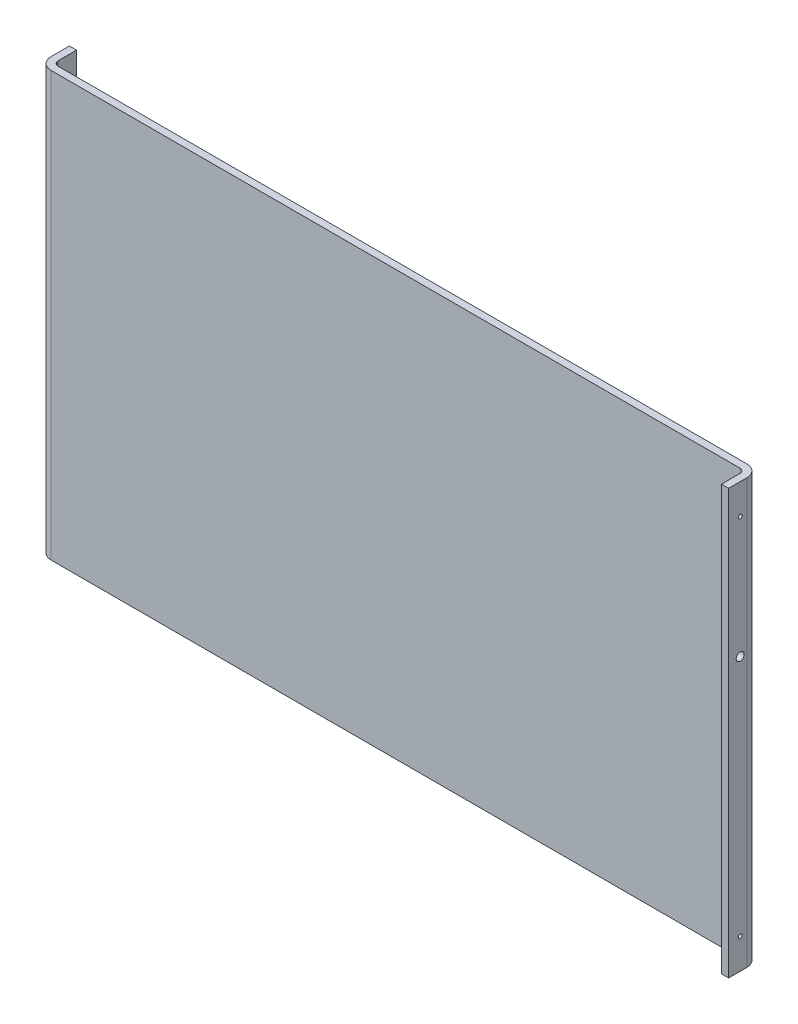
ISO-10303-21;
HEADER;
FILE_DESCRIPTION(('STEP AP214'),'2;1');
FILE_NAME('part.step','',(''),(''),'','','');
FILE_SCHEMA(('AUTOMOTIVE_DESIGN { 1 0 10303 214 1 1 1 1 }'));
ENDSEC;
DATA;
#1=APPLICATION_CONTEXT('core data for automotive mechanical design processes');
#2=APPLICATION_PROTOCOL_DEFINITION('international standard','automotive_design',2000,#1);
#3=PRODUCT_CONTEXT('',#1,'mechanical');
#4=PRODUCT('Part','Part','',(#3));
#5=PRODUCT_RELATED_PRODUCT_CATEGORY('part','',(#4));
#6=PRODUCT_DEFINITION_FORMATION('','',#4);
#7=PRODUCT_DEFINITION_CONTEXT('part definition',#1,'design');
#8=PRODUCT_DEFINITION('design','',#6,#7);
#9=PRODUCT_DEFINITION_SHAPE('','',#8);
#10=(LENGTH_UNIT() NAMED_UNIT(*) SI_UNIT(.MILLI.,.METRE.));
#11=(NAMED_UNIT(*) PLANE_ANGLE_UNIT() SI_UNIT($,.RADIAN.));
#12=(NAMED_UNIT(*) SI_UNIT($,.STERADIAN.) SOLID_ANGLE_UNIT());
#13=UNCERTAINTY_MEASURE_WITH_UNIT(LENGTH_MEASURE(1.E-05),#10,'distance_accuracy_value','');
#14=(GEOMETRIC_REPRESENTATION_CONTEXT(3) GLOBAL_UNCERTAINTY_ASSIGNED_CONTEXT((#13)) GLOBAL_UNIT_ASSIGNED_CONTEXT((#10,
#11,#12)) REPRESENTATION_CONTEXT('',''));
#15=CARTESIAN_POINT('',(0.,0.,0.));
#16=DIRECTION('',(0.,0.,1.));
#17=DIRECTION('',(1.,0.,0.));
#18=AXIS2_PLACEMENT_3D('',#15,#16,#17);
#19=CARTESIAN_POINT('',(295.800000062,152.4,12.7));
#20=DIRECTION('',(1.,0.,0.));
#21=DIRECTION('',(0.,0.,-1.));
#22=AXIS2_PLACEMENT_3D('',#19,#20,#21);
#23=CYLINDRICAL_SURFACE('',#22,1.6256);
#24=CARTESIAN_POINT('',(295.800000062,152.4,12.7));
#25=DIRECTION('',(1.,0.,0.));
#26=DIRECTION('',(0.,0.,-1.));
#27=AXIS2_PLACEMENT_3D('',#24,#25,#26);
#28=CIRCLE('',#27,1.6256);
#29=CARTESIAN_POINT('',(295.800000062,152.4,11.0744));
#30=VERTEX_POINT('',#29);
#31=EDGE_CURVE('E21',#30,#30,#28,.T.);
#32=ORIENTED_EDGE('',*,*,#31,.F.);
#33=EDGE_LOOP('',(#32));
#34=FACE_BOUND('',#33,.T.);
#35=CARTESIAN_POINT('',(301.8,152.4,12.7));
#36=DIRECTION('',(1.,0.,0.));
#37=DIRECTION('',(0.,0.,-1.));
#38=AXIS2_PLACEMENT_3D('',#35,#36,#37);
#39=CIRCLE('',#38,1.6256);
#40=CARTESIAN_POINT('',(301.8,152.4,11.0744));
#41=VERTEX_POINT('',#40);
#42=EDGE_CURVE('E144',#41,#41,#39,.T.);
#43=ORIENTED_EDGE('',*,*,#42,.T.);
#44=EDGE_LOOP('',(#43));
#45=FACE_BOUND('',#44,.T.);
#46=ADVANCED_FACE('F17',(#34,#45),#23,.F.);
#47=CARTESIAN_POINT('',(295.800000062,50.8,12.7));
#48=DIRECTION('',(1.,0.,0.));
#49=DIRECTION('',(0.,0.,-1.));
#50=AXIS2_PLACEMENT_3D('',#47,#48,#49);
#51=CYLINDRICAL_SURFACE('',#50,3.3655);
#52=CARTESIAN_POINT('',(295.800000062,50.8,12.7));
#53=DIRECTION('',(1.,0.,0.));
#54=DIRECTION('',(0.,0.,-1.));
#55=AXIS2_PLACEMENT_3D('',#52,#53,#54);
#56=CIRCLE('',#55,3.3655);
#57=CARTESIAN_POINT('',(295.800000062,50.8,9.3345));
#58=VERTEX_POINT('',#57);
#59=EDGE_CURVE('E151',#58,#58,#56,.T.);
#60=ORIENTED_EDGE('',*,*,#59,.F.);
#61=EDGE_LOOP('',(#60));
#62=FACE_BOUND('',#61,.T.);
#63=CARTESIAN_POINT('',(301.8,50.8,12.7));
#64=DIRECTION('',(1.,0.,0.));
#65=DIRECTION('',(0.,0.,-1.));
#66=AXIS2_PLACEMENT_3D('',#63,#64,#65);
#67=CIRCLE('',#66,3.3655);
#68=CARTESIAN_POINT('',(301.8,50.8,9.3345));
#69=VERTEX_POINT('',#68);
#70=EDGE_CURVE('E141',#69,#69,#67,.T.);
#71=ORIENTED_EDGE('',*,*,#70,.T.);
#72=EDGE_LOOP('',(#71));
#73=FACE_BOUND('',#72,.T.);
#74=ADVANCED_FACE('F317',(#62,#73),#51,.F.);
#75=CARTESIAN_POINT('',(295.800000062,-152.4,12.7));
#76=DIRECTION('',(1.,0.,0.));
#77=DIRECTION('',(0.,0.,-1.));
#78=AXIS2_PLACEMENT_3D('',#75,#76,#77);
#79=CYLINDRICAL_SURFACE('',#78,1.6256);
#80=CARTESIAN_POINT('',(295.800000062,-152.4,12.7));
#81=DIRECTION('',(1.,0.,0.));
#82=DIRECTION('',(0.,0.,-1.));
#83=AXIS2_PLACEMENT_3D('',#80,#81,#82);
#84=CIRCLE('',#83,1.6256);
#85=CARTESIAN_POINT('',(295.800000062,-152.4,11.0744));
#86=VERTEX_POINT('',#85);
#87=EDGE_CURVE('E148',#86,#86,#84,.T.);
#88=ORIENTED_EDGE('',*,*,#87,.F.);
#89=EDGE_LOOP('',(#88));
#90=FACE_BOUND('',#89,.T.);
#91=CARTESIAN_POINT('',(301.8,-152.4,12.7));
#92=DIRECTION('',(1.,0.,0.));
#93=DIRECTION('',(0.,0.,-1.));
#94=AXIS2_PLACEMENT_3D('',#91,#92,#93);
#95=CIRCLE('',#94,1.6256);
#96=CARTESIAN_POINT('',(301.8,-152.4,11.0744));
#97=VERTEX_POINT('',#96);
#98=EDGE_CURVE('E137',#97,#97,#95,.T.);
#99=ORIENTED_EDGE('',*,*,#98,.T.);
#100=EDGE_LOOP('',(#99));
#101=FACE_BOUND('',#100,.T.);
#102=ADVANCED_FACE('F308',(#90,#101),#79,.F.);
#103=CARTESIAN_POINT('',(291.800000062,177.8,6.999999938));
#104=DIRECTION('',(0.,-1.,0.));
#105=DIRECTION('',(0.,0.,-1.));
#106=AXIS2_PLACEMENT_3D('',#103,#104,#105);
#107=CYLINDRICAL_SURFACE('',#106,4.);
#108=CARTESIAN_POINT('',(291.800000062,177.8,6.999999938));
#109=DIRECTION('',(0.,-1.,0.));
#110=DIRECTION('',(0.,0.,-1.));
#111=AXIS2_PLACEMENT_3D('',#108,#109,#110);
#112=CIRCLE('',#111,4.);
#113=CARTESIAN_POINT('',(291.800000062,177.8,2.9999999306));
#114=VERTEX_POINT('',#113);
#115=CARTESIAN_POINT('',(295.799999924511,177.8,6.999999938));
#116=VERTEX_POINT('',#115);
#117=EDGE_CURVE('E208',#114,#116,#112,.T.);
#118=ORIENTED_EDGE('',*,*,#117,.F.);
#119=DIRECTION('',(0.,1.,0.));
#120=VECTOR('',#119,1.);
#121=CARTESIAN_POINT('',(291.800000062,0.,2.999999938));
#122=LINE('',#121,#120);
#123=CARTESIAN_POINT('',(291.800000062,-177.8,2.9999999306));
#124=VERTEX_POINT('',#123);
#125=EDGE_CURVE('E125',#124,#114,#122,.T.);
#126=ORIENTED_EDGE('',*,*,#125,.F.);
#127=CARTESIAN_POINT('',(291.800000062,-177.8,6.999999938));
#128=DIRECTION('',(0.,-1.,0.));
#129=DIRECTION('',(0.,0.,-1.));
#130=AXIS2_PLACEMENT_3D('',#127,#128,#129);
#131=CIRCLE('',#130,4.);
#132=CARTESIAN_POINT('',(295.799999924511,-177.8,6.999999938));
#133=VERTEX_POINT('',#132);
#134=EDGE_CURVE('E203',#124,#133,#131,.T.);
#135=ORIENTED_EDGE('',*,*,#134,.T.);
#136=DIRECTION('',(0.,-1.,0.));
#137=VECTOR('',#136,1.);
#138=CARTESIAN_POINT('',(295.800000062,0.,6.999999938));
#139=LINE('',#138,#137);
#140=EDGE_CURVE('E156',#116,#133,#139,.T.);
#141=ORIENTED_EDGE('',*,*,#140,.F.);
#142=EDGE_LOOP('',(#118,#126,#135,#141));
#143=FACE_BOUND('',#142,.T.);
#144=ADVANCED_FACE('F306',(#143),#107,.F.);
#145=CARTESIAN_POINT('',(295.800000062,-177.8,6.999999938));
#146=DIRECTION('',(-1.,0.,0.));
#147=DIRECTION('',(0.,0.,1.));
#148=AXIS2_PLACEMENT_3D('',#145,#146,#147);
#149=PLANE('',#148);
#150=ORIENTED_EDGE('',*,*,#87,.T.);
#151=EDGE_LOOP('',(#150));
#152=FACE_BOUND('',#151,.T.);
#153=ORIENTED_EDGE('',*,*,#59,.T.);
#154=EDGE_LOOP('',(#153));
#155=FACE_BOUND('',#154,.T.);
#156=ORIENTED_EDGE('',*,*,#31,.T.);
#157=EDGE_LOOP('',(#156));
#158=FACE_BOUND('',#157,.T.);
#159=DIRECTION('',(0.,1.,0.));
#160=VECTOR('',#159,1.);
#161=CARTESIAN_POINT('',(295.800000062,0.,22.4));
#162=LINE('',#161,#160);
#163=CARTESIAN_POINT('',(295.799999878682,-177.8,22.4));
#164=VERTEX_POINT('',#163);
#165=CARTESIAN_POINT('',(295.799999878682,177.8,22.4));
#166=VERTEX_POINT('',#165);
#167=EDGE_CURVE('E150',#164,#166,#162,.T.);
#168=ORIENTED_EDGE('',*,*,#167,.T.);
#169=DIRECTION('',(0.,0.,1.));
#170=VECTOR('',#169,1.);
#171=CARTESIAN_POINT('',(295.799999787023,177.8,0.));
#172=LINE('',#171,#170);
#173=EDGE_CURVE('E172',#116,#166,#172,.T.);
#174=ORIENTED_EDGE('',*,*,#173,.F.);
#175=ORIENTED_EDGE('',*,*,#140,.T.);
#176=DIRECTION('',(0.,0.,1.));
#177=VECTOR('',#176,1.);
#178=CARTESIAN_POINT('',(295.799999787023,-177.8,0.));
#179=LINE('',#178,#177);
#180=EDGE_CURVE('E206',#133,#164,#179,.T.);
#181=ORIENTED_EDGE('',*,*,#180,.T.);
#182=EDGE_LOOP('',(#168,#174,#175,#181));
#183=FACE_BOUND('',#182,.T.);
#184=ADVANCED_FACE('F247',(#152,#155,#158,#183),#149,.T.);
#185=CARTESIAN_POINT('',(301.8,-177.8,22.4));
#186=DIRECTION('',(0.,0.,-1.));
#187=DIRECTION('',(-1.,0.,0.));
#188=AXIS2_PLACEMENT_3D('',#185,#186,#187);
#189=PLANE('',#188);
#190=DIRECTION('',(0.,1.,0.));
#191=VECTOR('',#190,1.);
#192=CARTESIAN_POINT('',(301.8,0.,22.4));
#193=LINE('',#192,#191);
#194=CARTESIAN_POINT('',(301.8,-177.8,22.4));
#195=VERTEX_POINT('',#194);
#196=CARTESIAN_POINT('',(301.8,177.8,22.4));
#197=VERTEX_POINT('',#196);
#198=EDGE_CURVE('E147',#195,#197,#193,.T.);
#199=ORIENTED_EDGE('',*,*,#198,.T.);
#200=DIRECTION('',(1.,0.,0.));
#201=VECTOR('',#200,1.);
#202=CARTESIAN_POINT('',(3.00000003100004,177.8,22.4));
#203=LINE('',#202,#201);
#204=EDGE_CURVE('E169',#166,#197,#203,.T.);
#205=ORIENTED_EDGE('',*,*,#204,.F.);
#206=ORIENTED_EDGE('',*,*,#167,.F.);
#207=DIRECTION('',(1.,0.,0.));
#208=VECTOR('',#207,1.);
#209=CARTESIAN_POINT('',(3.00000003100004,-177.8,22.4));
#210=LINE('',#209,#208);
#211=EDGE_CURVE('E241',#164,#195,#210,.T.);
#212=ORIENTED_EDGE('',*,*,#211,.T.);
#213=EDGE_LOOP('',(#199,#205,#206,#212));
#214=FACE_BOUND('',#213,.T.);
#215=ADVANCED_FACE('F250',(#214),#189,.F.);
#216=CARTESIAN_POINT('',(301.8,-177.8,6.999999938));
#217=DIRECTION('',(-1.,0.,0.));
#218=DIRECTION('',(0.,0.,1.));
#219=AXIS2_PLACEMENT_3D('',#216,#217,#218);
#220=PLANE('',#219);
#221=ORIENTED_EDGE('',*,*,#98,.F.);
#222=EDGE_LOOP('',(#221));
#223=FACE_BOUND('',#222,.T.);
#224=ORIENTED_EDGE('',*,*,#70,.F.);
#225=EDGE_LOOP('',(#224));
#226=FACE_BOUND('',#225,.T.);
#227=ORIENTED_EDGE('',*,*,#42,.F.);
#228=EDGE_LOOP('',(#227));
#229=FACE_BOUND('',#228,.T.);
#230=ORIENTED_EDGE('',*,*,#198,.F.);
#231=DIRECTION('',(0.,0.,-1.));
#232=VECTOR('',#231,1.);
#233=CARTESIAN_POINT('',(301.8,-177.8,0.));
#234=LINE('',#233,#232);
#235=CARTESIAN_POINT('',(301.8,-177.8,6.99999993902551));
#236=VERTEX_POINT('',#235);
#237=EDGE_CURVE('E202',#195,#236,#234,.T.);
#238=ORIENTED_EDGE('',*,*,#237,.T.);
#239=DIRECTION('',(0.,-1.,0.));
#240=VECTOR('',#239,1.);
#241=CARTESIAN_POINT('',(301.8,0.,6.99999994005102));
#242=LINE('',#241,#240);
#243=CARTESIAN_POINT('',(301.8,177.8,6.99999993902551));
#244=VERTEX_POINT('',#243);
#245=EDGE_CURVE('E140',#236,#244,#242,.F.);
#246=ORIENTED_EDGE('',*,*,#245,.T.);
#247=DIRECTION('',(0.,0.,-1.));
#248=VECTOR('',#247,1.);
#249=CARTESIAN_POINT('',(301.8,177.8,0.));
#250=LINE('',#249,#248);
#251=EDGE_CURVE('E171',#197,#244,#250,.T.);
#252=ORIENTED_EDGE('',*,*,#251,.F.);
#253=EDGE_LOOP('',(#230,#238,#246,#252));
#254=FACE_BOUND('',#253,.T.);
#255=ADVANCED_FACE('F255',(#223,#226,#229,#254),#220,.F.);
#256=CARTESIAN_POINT('',(291.800000062,177.8,6.999999938));
#257=DIRECTION('',(0.,-1.,0.));
#258=DIRECTION('',(0.,0.,-1.));
#259=AXIS2_PLACEMENT_3D('',#256,#257,#258);
#260=CYLINDRICAL_SURFACE('',#259,9.999999938);
#261=CARTESIAN_POINT('',(291.800000062,177.8,6.999999938));
#262=DIRECTION('',(0.,-1.,0.));
#263=DIRECTION('',(0.,0.,-1.));
#264=AXIS2_PLACEMENT_3D('',#261,#262,#263);
#265=CIRCLE('',#264,9.999999938);
#266=CARTESIAN_POINT('',(291.800000062,177.8,-3.0000000064));
#267=VERTEX_POINT('',#266);
#268=EDGE_CURVE('E113',#244,#267,#265,.F.);
#269=ORIENTED_EDGE('',*,*,#268,.F.);
#270=ORIENTED_EDGE('',*,*,#245,.F.);
#271=CARTESIAN_POINT('',(291.800000062,-177.8,6.999999938));
#272=DIRECTION('',(0.,-1.,0.));
#273=DIRECTION('',(0.,0.,-1.));
#274=AXIS2_PLACEMENT_3D('',#271,#272,#273);
#275=CIRCLE('',#274,9.999999938);
#276=CARTESIAN_POINT('',(291.800000062,-177.8,-3.0000000064));
#277=VERTEX_POINT('',#276);
#278=EDGE_CURVE('E199',#236,#277,#275,.F.);
#279=ORIENTED_EDGE('',*,*,#278,.T.);
#280=DIRECTION('',(0.,1.,0.));
#281=VECTOR('',#280,1.);
#282=CARTESIAN_POINT('',(291.800000062,0.,-3.));
#283=LINE('',#282,#281);
#284=EDGE_CURVE('E232',#277,#267,#283,.T.);
#285=ORIENTED_EDGE('',*,*,#284,.T.);
#286=EDGE_LOOP('',(#269,#270,#279,#285));
#287=FACE_BOUND('',#286,.T.);
#288=ADVANCED_FACE('F259',(#287),#260,.T.);
#289=CARTESIAN_POINT('',(-285.8,-177.8,-3.));
#290=DIRECTION('',(0.,0.,1.));
#291=DIRECTION('',(1.,0.,0.));
#292=AXIS2_PLACEMENT_3D('',#289,#290,#291);
#293=PLANE('',#292);
#294=ORIENTED_EDGE('',*,*,#284,.F.);
#295=DIRECTION('',(-1.,0.,0.));
#296=VECTOR('',#295,1.);
#297=CARTESIAN_POINT('',(3.00000003100004,-177.8,-3.0000000128));
#298=LINE('',#297,#296);
#299=CARTESIAN_POINT('',(-285.800000000359,-177.8,-3.0000000064));
#300=VERTEX_POINT('',#299);
#301=EDGE_CURVE('E121',#277,#300,#298,.T.);
#302=ORIENTED_EDGE('',*,*,#301,.T.);
#303=DIRECTION('',(0.,1.,0.));
#304=VECTOR('',#303,1.);
#305=CARTESIAN_POINT('',(-285.800000000718,0.,-3.));
#306=LINE('',#305,#304);
#307=CARTESIAN_POINT('',(-285.800000000359,177.8,-3.0000000064));
#308=VERTEX_POINT('',#307);
#309=EDGE_CURVE('E118',#308,#300,#306,.F.);
#310=ORIENTED_EDGE('',*,*,#309,.F.);
#311=DIRECTION('',(-1.,0.,0.));
#312=VECTOR('',#311,1.);
#313=CARTESIAN_POINT('',(3.00000003100004,177.8,-3.0000000128));
#314=LINE('',#313,#312);
#315=EDGE_CURVE('E105',#267,#308,#314,.T.);
#316=ORIENTED_EDGE('',*,*,#315,.F.);
#317=EDGE_LOOP('',(#294,#302,#310,#316));
#318=FACE_BOUND('',#317,.T.);
#319=ADVANCED_FACE('F119',(#318),#293,.F.);
#320=CARTESIAN_POINT('',(-285.8,-177.8,2.999999938));
#321=DIRECTION('',(0.,0.,1.));
#322=DIRECTION('',(1.,0.,0.));
#323=AXIS2_PLACEMENT_3D('',#320,#321,#322);
#324=PLANE('',#323);
#325=ORIENTED_EDGE('',*,*,#125,.T.);
#326=DIRECTION('',(1.,0.,0.));
#327=VECTOR('',#326,1.);
#328=CARTESIAN_POINT('',(3.00000003100004,177.8,2.9999999232));
#329=LINE('',#328,#327);
#330=CARTESIAN_POINT('',(-285.800000000898,177.8,2.9999999306));
#331=VERTEX_POINT('',#330);
#332=EDGE_CURVE('E133',#331,#114,#329,.T.);
#333=ORIENTED_EDGE('',*,*,#332,.F.);
#334=DIRECTION('',(0.,1.,0.));
#335=VECTOR('',#334,1.);
#336=CARTESIAN_POINT('',(-285.800000001796,0.,2.999999938));
#337=LINE('',#336,#335);
#338=CARTESIAN_POINT('',(-285.800000000898,-177.8,2.9999999306));
#339=VERTEX_POINT('',#338);
#340=EDGE_CURVE('E115',#331,#339,#337,.F.);
#341=ORIENTED_EDGE('',*,*,#340,.T.);
#342=DIRECTION('',(1.,0.,0.));
#343=VECTOR('',#342,1.);
#344=CARTESIAN_POINT('',(3.00000003100004,-177.8,2.9999999232));
#345=LINE('',#344,#343);
#346=EDGE_CURVE('E195',#339,#124,#345,.T.);
#347=ORIENTED_EDGE('',*,*,#346,.T.);
#348=EDGE_LOOP('',(#325,#333,#341,#347));
#349=FACE_BOUND('',#348,.T.);
#350=ADVANCED_FACE('F302',(#349),#324,.T.);
#351=CARTESIAN_POINT('',(-285.8,-177.8,-7.));
#352=DIRECTION('',(0.,1.,0.));
#353=DIRECTION('',(0.,0.,1.));
#354=AXIS2_PLACEMENT_3D('',#351,#352,#353);
#355=CYLINDRICAL_SURFACE('',#354,4.);
#356=CARTESIAN_POINT('',(-285.8,177.8,-7.));
#357=DIRECTION('',(0.,1.,0.));
#358=DIRECTION('',(0.,0.,1.));
#359=AXIS2_PLACEMENT_3D('',#356,#357,#358);
#360=CIRCLE('',#359,4.);
#361=CARTESIAN_POINT('',(-289.8,177.8,-7.));
#362=VERTEX_POINT('',#361);
#363=EDGE_CURVE('E110',#308,#362,#360,.F.);
#364=ORIENTED_EDGE('',*,*,#363,.F.);
#365=ORIENTED_EDGE('',*,*,#309,.T.);
#366=CARTESIAN_POINT('',(-285.8,-177.8,-7.));
#367=DIRECTION('',(0.,1.,0.));
#368=DIRECTION('',(0.,0.,1.));
#369=AXIS2_PLACEMENT_3D('',#366,#367,#368);
#370=CIRCLE('',#369,4.);
#371=CARTESIAN_POINT('',(-289.8,-177.8,-7.));
#372=VERTEX_POINT('',#371);
#373=EDGE_CURVE('E197',#300,#372,#370,.F.);
#374=ORIENTED_EDGE('',*,*,#373,.T.);
#375=DIRECTION('',(0.,1.,0.));
#376=VECTOR('',#375,1.);
#377=CARTESIAN_POINT('',(-289.8,0.,-7.));
#378=LINE('',#377,#376);
#379=EDGE_CURVE('E129',#372,#362,#378,.T.);
#380=ORIENTED_EDGE('',*,*,#379,.T.);
#381=EDGE_LOOP('',(#364,#365,#374,#380));
#382=FACE_BOUND('',#381,.T.);
#383=ADVANCED_FACE('F128',(#382),#355,.F.);
#384=CARTESIAN_POINT('',(-285.8,-177.8,-7.));
#385=DIRECTION('',(0.,1.,0.));
#386=DIRECTION('',(0.,0.,1.));
#387=AXIS2_PLACEMENT_3D('',#384,#385,#386);
#388=CYLINDRICAL_SURFACE('',#387,9.999999938);
#389=CARTESIAN_POINT('',(-285.8,177.8,-7.));
#390=DIRECTION('',(0.,1.,0.));
#391=DIRECTION('',(0.,0.,1.));
#392=AXIS2_PLACEMENT_3D('',#389,#390,#391);
#393=CIRCLE('',#392,9.999999938);
#394=CARTESIAN_POINT('',(-295.799999938,177.8,-7.));
#395=VERTEX_POINT('',#394);
#396=EDGE_CURVE('E130',#395,#331,#393,.T.);
#397=ORIENTED_EDGE('',*,*,#396,.F.);
#398=DIRECTION('',(0.,1.,0.));
#399=VECTOR('',#398,1.);
#400=CARTESIAN_POINT('',(-295.799999938,0.,-7.));
#401=LINE('',#400,#399);
#402=CARTESIAN_POINT('',(-295.799999938,-177.8,-7.));
#403=VERTEX_POINT('',#402);
#404=EDGE_CURVE('E187',#403,#395,#401,.T.);
#405=ORIENTED_EDGE('',*,*,#404,.F.);
#406=CARTESIAN_POINT('',(-285.8,-177.8,-7.));
#407=DIRECTION('',(0.,1.,0.));
#408=DIRECTION('',(0.,0.,1.));
#409=AXIS2_PLACEMENT_3D('',#406,#407,#408);
#410=CIRCLE('',#409,9.999999938);
#411=EDGE_CURVE('E192',#403,#339,#410,.T.);
#412=ORIENTED_EDGE('',*,*,#411,.T.);
#413=ORIENTED_EDGE('',*,*,#340,.F.);
#414=EDGE_LOOP('',(#397,#405,#412,#413));
#415=FACE_BOUND('',#414,.T.);
#416=ADVANCED_FACE('F300',(#415),#388,.T.);
#417=CARTESIAN_POINT('',(-295.799999938,177.8,-22.4));
#418=DIRECTION('',(0.,1.,0.));
#419=DIRECTION('',(0.,0.,1.));
#420=AXIS2_PLACEMENT_3D('',#417,#418,#419);
#421=PLANE('',#420);
#422=ORIENTED_EDGE('',*,*,#251,.T.);
#423=ORIENTED_EDGE('',*,*,#268,.T.);
#424=ORIENTED_EDGE('',*,*,#315,.T.);
#425=ORIENTED_EDGE('',*,*,#363,.T.);
#426=DIRECTION('',(0.,0.,-1.));
#427=VECTOR('',#426,1.);
#428=CARTESIAN_POINT('',(-289.8,177.8,-14.7));
#429=LINE('',#428,#427);
#430=CARTESIAN_POINT('',(-289.8,177.8,-22.4));
#431=VERTEX_POINT('',#430);
#432=EDGE_CURVE('E218',#362,#431,#429,.T.);
#433=ORIENTED_EDGE('',*,*,#432,.T.);
#434=DIRECTION('',(1.,0.,0.));
#435=VECTOR('',#434,1.);
#436=CARTESIAN_POINT('',(-292.799999969,177.8,-22.4));
#437=LINE('',#436,#435);
#438=CARTESIAN_POINT('',(-295.799999938,177.8,-22.4));
#439=VERTEX_POINT('',#438);
#440=EDGE_CURVE('E207',#439,#431,#437,.T.);
#441=ORIENTED_EDGE('',*,*,#440,.F.);
#442=DIRECTION('',(0.,0.,-1.));
#443=VECTOR('',#442,1.);
#444=CARTESIAN_POINT('',(-295.799999938,177.8,-14.7));
#445=LINE('',#444,#443);
#446=EDGE_CURVE('E272',#395,#439,#445,.T.);
#447=ORIENTED_EDGE('',*,*,#446,.F.);
#448=ORIENTED_EDGE('',*,*,#396,.T.);
#449=ORIENTED_EDGE('',*,*,#332,.T.);
#450=ORIENTED_EDGE('',*,*,#117,.T.);
#451=ORIENTED_EDGE('',*,*,#173,.T.);
#452=ORIENTED_EDGE('',*,*,#204,.T.);
#453=EDGE_LOOP('',(#422,#423,#424,#425,#433,#441,#447,#448,#449,#450,#451,#452));
#454=FACE_BOUND('',#453,.T.);
#455=ADVANCED_FACE('F107',(#454),#421,.T.);
#456=CARTESIAN_POINT('',(-289.8,-177.8,-22.4));
#457=DIRECTION('',(0.,0.,-1.));
#458=DIRECTION('',(-1.,0.,0.));
#459=AXIS2_PLACEMENT_3D('',#456,#457,#458);
#460=PLANE('',#459);
#461=DIRECTION('',(0.,-1.,0.));
#462=VECTOR('',#461,1.);
#463=CARTESIAN_POINT('',(-295.799999938,0.,-22.4));
#464=LINE('',#463,#462);
#465=CARTESIAN_POINT('',(-295.799999938,-177.8,-22.4));
#466=VERTEX_POINT('',#465);
#467=EDGE_CURVE('E36',#439,#466,#464,.T.);
#468=ORIENTED_EDGE('',*,*,#467,.F.);
#469=ORIENTED_EDGE('',*,*,#440,.T.);
#470=DIRECTION('',(0.,-1.,0.));
#471=VECTOR('',#470,1.);
#472=CARTESIAN_POINT('',(-289.8,0.,-22.4));
#473=LINE('',#472,#471);
#474=CARTESIAN_POINT('',(-289.799999908341,-177.8,-22.4));
#475=VERTEX_POINT('',#474);
#476=EDGE_CURVE('E221',#431,#475,#473,.T.);
#477=ORIENTED_EDGE('',*,*,#476,.T.);
#478=DIRECTION('',(-1.,0.,0.));
#479=VECTOR('',#478,1.);
#480=CARTESIAN_POINT('',(3.00000003100004,-177.8,-22.4));
#481=LINE('',#480,#479);
#482=EDGE_CURVE('E196',#475,#466,#481,.T.);
#483=ORIENTED_EDGE('',*,*,#482,.T.);
#484=EDGE_LOOP('',(#468,#469,#477,#483));
#485=FACE_BOUND('',#484,.T.);
#486=ADVANCED_FACE('F295',(#485),#460,.T.);
#487=CARTESIAN_POINT('',(-295.799999938,-177.8,-22.4));
#488=DIRECTION('',(0.,1.,0.));
#489=DIRECTION('',(0.,0.,1.));
#490=AXIS2_PLACEMENT_3D('',#487,#488,#489);
#491=PLANE('',#490);
#492=ORIENTED_EDGE('',*,*,#411,.F.);
#493=DIRECTION('',(0.,0.,1.));
#494=VECTOR('',#493,1.);
#495=CARTESIAN_POINT('',(-295.799999938,-177.8,-14.7));
#496=LINE('',#495,#494);
#497=EDGE_CURVE('E183',#466,#403,#496,.T.);
#498=ORIENTED_EDGE('',*,*,#497,.F.);
#499=ORIENTED_EDGE('',*,*,#482,.F.);
#500=DIRECTION('',(0.,0.,1.));
#501=VECTOR('',#500,1.);
#502=CARTESIAN_POINT('',(-289.8,-177.8,-14.7));
#503=LINE('',#502,#501);
#504=EDGE_CURVE('E191',#475,#372,#503,.T.);
#505=ORIENTED_EDGE('',*,*,#504,.T.);
#506=ORIENTED_EDGE('',*,*,#373,.F.);
#507=ORIENTED_EDGE('',*,*,#301,.F.);
#508=ORIENTED_EDGE('',*,*,#278,.F.);
#509=ORIENTED_EDGE('',*,*,#237,.F.);
#510=ORIENTED_EDGE('',*,*,#211,.F.);
#511=ORIENTED_EDGE('',*,*,#180,.F.);
#512=ORIENTED_EDGE('',*,*,#134,.F.);
#513=ORIENTED_EDGE('',*,*,#346,.F.);
#514=EDGE_LOOP('',(#492,#498,#499,#505,#506,#507,#508,#509,#510,#511,#512,#513));
#515=FACE_BOUND('',#514,.T.);
#516=ADVANCED_FACE('F261',(#515),#491,.F.);
#517=CARTESIAN_POINT('',(-289.8,50.8,-12.7));
#518=DIRECTION('',(-1.,0.,0.));
#519=DIRECTION('',(0.,-1.,0.));
#520=AXIS2_PLACEMENT_3D('',#517,#518,#519);
#521=CYLINDRICAL_SURFACE('',#520,3.3655);
#522=CARTESIAN_POINT('',(-289.8,50.8,-12.7));
#523=DIRECTION('',(-1.,0.,0.));
#524=DIRECTION('',(0.,-1.,0.));
#525=AXIS2_PLACEMENT_3D('',#522,#523,#524);
#526=CIRCLE('',#525,3.3655);
#527=CARTESIAN_POINT('',(-289.8,47.4345,-12.7));
#528=VERTEX_POINT('',#527);
#529=EDGE_CURVE('E188',#528,#528,#526,.F.);
#530=ORIENTED_EDGE('',*,*,#529,.T.);
#531=EDGE_LOOP('',(#530));
#532=FACE_BOUND('',#531,.T.);
#533=CARTESIAN_POINT('',(-295.799999938,50.8,-12.7));
#534=DIRECTION('',(-1.,0.,0.));
#535=DIRECTION('',(0.,-1.,0.));
#536=AXIS2_PLACEMENT_3D('',#533,#534,#535);
#537=CIRCLE('',#536,3.3655);
#538=CARTESIAN_POINT('',(-295.799999938,47.4345,-12.7));
#539=VERTEX_POINT('',#538);
#540=EDGE_CURVE('E180',#539,#539,#537,.F.);
#541=ORIENTED_EDGE('',*,*,#540,.F.);
#542=EDGE_LOOP('',(#541));
#543=FACE_BOUND('',#542,.T.);
#544=ADVANCED_FACE('F335',(#532,#543),#521,.F.);
#545=CARTESIAN_POINT('',(-289.8,152.4,-12.7));
#546=DIRECTION('',(-1.,0.,0.));
#547=DIRECTION('',(0.,-1.,0.));
#548=AXIS2_PLACEMENT_3D('',#545,#546,#547);
#549=CYLINDRICAL_SURFACE('',#548,1.6256);
#550=CARTESIAN_POINT('',(-289.8,152.4,-12.7));
#551=DIRECTION('',(-1.,0.,0.));
#552=DIRECTION('',(0.,-1.,0.));
#553=AXIS2_PLACEMENT_3D('',#550,#551,#552);
#554=CIRCLE('',#553,1.6256);
#555=CARTESIAN_POINT('',(-289.8,150.7744,-12.7));
#556=VERTEX_POINT('',#555);
#557=EDGE_CURVE('E184',#556,#556,#554,.F.);
#558=ORIENTED_EDGE('',*,*,#557,.T.);
#559=EDGE_LOOP('',(#558));
#560=FACE_BOUND('',#559,.T.);
#561=CARTESIAN_POINT('',(-295.799999938,152.4,-12.7));
#562=DIRECTION('',(-1.,0.,0.));
#563=DIRECTION('',(0.,-1.,0.));
#564=AXIS2_PLACEMENT_3D('',#561,#562,#563);
#565=CIRCLE('',#564,1.6256);
#566=CARTESIAN_POINT('',(-295.799999938,150.7744,-12.7));
#567=VERTEX_POINT('',#566);
#568=EDGE_CURVE('E177',#567,#567,#565,.F.);
#569=ORIENTED_EDGE('',*,*,#568,.F.);
#570=EDGE_LOOP('',(#569));
#571=FACE_BOUND('',#570,.T.);
#572=ADVANCED_FACE('F332',(#560,#571),#549,.F.);
#573=CARTESIAN_POINT('',(-289.8,-177.8,-22.4));
#574=DIRECTION('',(-1.,0.,0.));
#575=DIRECTION('',(0.,0.,1.));
#576=AXIS2_PLACEMENT_3D('',#573,#574,#575);
#577=PLANE('',#576);
#578=ORIENTED_EDGE('',*,*,#557,.F.);
#579=EDGE_LOOP('',(#578));
#580=FACE_BOUND('',#579,.T.);
#581=ORIENTED_EDGE('',*,*,#529,.F.);
#582=EDGE_LOOP('',(#581));
#583=FACE_BOUND('',#582,.T.);
#584=CARTESIAN_POINT('',(-289.8,-152.4,-12.7));
#585=DIRECTION('',(-1.,0.,0.));
#586=DIRECTION('',(0.,-1.,0.));
#587=AXIS2_PLACEMENT_3D('',#584,#585,#586);
#588=CIRCLE('',#587,1.6256);
#589=CARTESIAN_POINT('',(-289.8,-154.0256,-12.7));
#590=VERTEX_POINT('',#589);
#591=EDGE_CURVE('E27',#590,#590,#588,.F.);
#592=ORIENTED_EDGE('',*,*,#591,.F.);
#593=EDGE_LOOP('',(#592));
#594=FACE_BOUND('',#593,.T.);
#595=ORIENTED_EDGE('',*,*,#476,.F.);
#596=ORIENTED_EDGE('',*,*,#432,.F.);
#597=ORIENTED_EDGE('',*,*,#379,.F.);
#598=ORIENTED_EDGE('',*,*,#504,.F.);
#599=EDGE_LOOP('',(#595,#596,#597,#598));
#600=FACE_BOUND('',#599,.T.);
#601=ADVANCED_FACE('F328',(#580,#583,#594,#600),#577,.F.);
#602=CARTESIAN_POINT('',(-295.799999938,-177.8,-22.4));
#603=DIRECTION('',(-1.,0.,0.));
#604=DIRECTION('',(0.,0.,1.));
#605=AXIS2_PLACEMENT_3D('',#602,#603,#604);
#606=PLANE('',#605);
#607=ORIENTED_EDGE('',*,*,#568,.T.);
#608=EDGE_LOOP('',(#607));
#609=FACE_BOUND('',#608,.T.);
#610=ORIENTED_EDGE('',*,*,#540,.T.);
#611=EDGE_LOOP('',(#610));
#612=FACE_BOUND('',#611,.T.);
#613=CARTESIAN_POINT('',(-295.799999938,-152.4,-12.7));
#614=DIRECTION('',(-1.,0.,0.));
#615=DIRECTION('',(0.,-1.,0.));
#616=AXIS2_PLACEMENT_3D('',#613,#614,#615);
#617=CIRCLE('',#616,1.6256);
#618=CARTESIAN_POINT('',(-295.799999938,-154.0256,-12.7));
#619=VERTEX_POINT('',#618);
#620=EDGE_CURVE('E11',#619,#619,#617,.T.);
#621=ORIENTED_EDGE('',*,*,#620,.F.);
#622=EDGE_LOOP('',(#621));
#623=FACE_BOUND('',#622,.T.);
#624=ORIENTED_EDGE('',*,*,#467,.T.);
#625=ORIENTED_EDGE('',*,*,#497,.T.);
#626=ORIENTED_EDGE('',*,*,#404,.T.);
#627=ORIENTED_EDGE('',*,*,#446,.T.);
#628=EDGE_LOOP('',(#624,#625,#626,#627));
#629=FACE_BOUND('',#628,.T.);
#630=ADVANCED_FACE('F19',(#609,#612,#623,#629),#606,.T.);
#631=CARTESIAN_POINT('',(-289.8,-152.4,-12.7));
#632=DIRECTION('',(-1.,0.,0.));
#633=DIRECTION('',(0.,-1.,0.));
#634=AXIS2_PLACEMENT_3D('',#631,#632,#633);
#635=CYLINDRICAL_SURFACE('',#634,1.6256);
#636=ORIENTED_EDGE('',*,*,#620,.T.);
#637=EDGE_LOOP('',(#636));
#638=FACE_BOUND('',#637,.T.);
#639=ORIENTED_EDGE('',*,*,#591,.T.);
#640=EDGE_LOOP('',(#639));
#641=FACE_BOUND('',#640,.T.);
#642=ADVANCED_FACE('F321',(#638,#641),#635,.F.);
#643=CLOSED_SHELL('',(#46,#74,#102,#144,#184,#215,#255,#288,#319,#350,#383,#416,#455,#486,#516,
#544,#572,#601,#630,#642));
#644=MANIFOLD_SOLID_BREP('B1',#643);
#645=ADVANCED_BREP_SHAPE_REPRESENTATION('',(#18,#644),#14);
#646=SHAPE_DEFINITION_REPRESENTATION(#9,#645);
ENDSEC;
END-ISO-10303-21;
